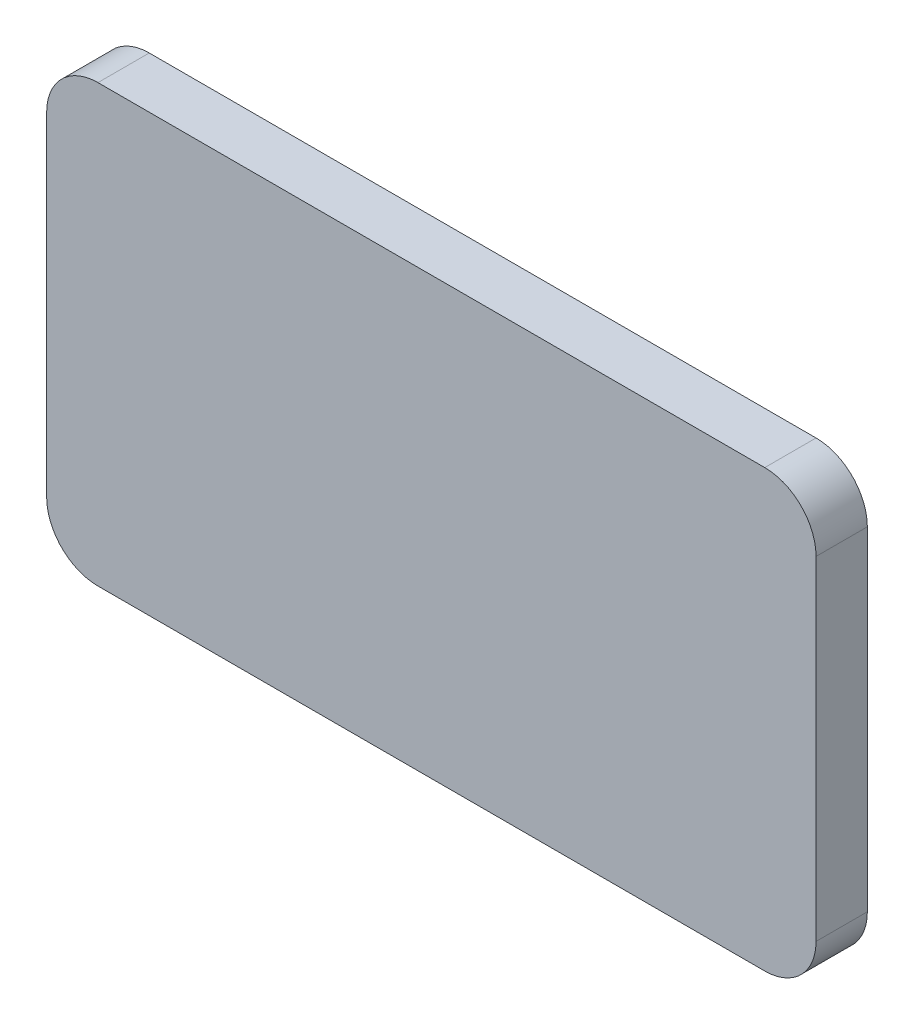
ISO-10303-21;
HEADER;
FILE_DESCRIPTION(('STEP AP214'),'2;1');
FILE_NAME('part.step','',(''),(''),'','','');
FILE_SCHEMA(('AUTOMOTIVE_DESIGN { 1 0 10303 214 1 1 1 1 }'));
ENDSEC;
DATA;
#1=APPLICATION_CONTEXT('core data for automotive mechanical design processes');
#2=APPLICATION_PROTOCOL_DEFINITION('international standard','automotive_design',2000,#1);
#3=PRODUCT_CONTEXT('',#1,'mechanical');
#4=PRODUCT('Part','Part','',(#3));
#5=PRODUCT_RELATED_PRODUCT_CATEGORY('part','',(#4));
#6=PRODUCT_DEFINITION_FORMATION('','',#4);
#7=PRODUCT_DEFINITION_CONTEXT('part definition',#1,'design');
#8=PRODUCT_DEFINITION('design','',#6,#7);
#9=PRODUCT_DEFINITION_SHAPE('','',#8);
#10=(LENGTH_UNIT() NAMED_UNIT(*) SI_UNIT(.MILLI.,.METRE.));
#11=(NAMED_UNIT(*) PLANE_ANGLE_UNIT() SI_UNIT($,.RADIAN.));
#12=(NAMED_UNIT(*) SI_UNIT($,.STERADIAN.) SOLID_ANGLE_UNIT());
#13=UNCERTAINTY_MEASURE_WITH_UNIT(LENGTH_MEASURE(1.E-05),#10,'distance_accuracy_value','');
#14=(GEOMETRIC_REPRESENTATION_CONTEXT(3) GLOBAL_UNCERTAINTY_ASSIGNED_CONTEXT((#13)) GLOBAL_UNIT_ASSIGNED_CONTEXT((#10,
#11,#12)) REPRESENTATION_CONTEXT('',''));
#15=CARTESIAN_POINT('',(0.,0.,0.));
#16=DIRECTION('',(0.,0.,1.));
#17=DIRECTION('',(1.,0.,0.));
#18=AXIS2_PLACEMENT_3D('',#15,#16,#17);
#19=CARTESIAN_POINT('',(0.,0.,2.));
#20=DIRECTION('',(1.,0.,0.));
#21=DIRECTION('',(0.,1.,0.));
#22=AXIS2_PLACEMENT_3D('',#19,#20,#21);
#23=PLANE('',#22);
#24=DIRECTION('',(0.,-1.,0.));
#25=VECTOR('',#24,1.);
#26=CARTESIAN_POINT('',(0.,0.,2.));
#27=LINE('',#26,#25);
#28=CARTESIAN_POINT('',(0.,-2.,2.));
#29=VERTEX_POINT('',#28);
#30=CARTESIAN_POINT('',(0.,-15.,2.));
#31=VERTEX_POINT('',#30);
#32=EDGE_CURVE('E117',#29,#31,#27,.T.);
#33=ORIENTED_EDGE('',*,*,#32,.F.);
#34=DIRECTION('',(0.,0.,-1.));
#35=VECTOR('',#34,1.);
#36=CARTESIAN_POINT('',(0.,-2.,2.));
#37=LINE('',#36,#35);
#38=CARTESIAN_POINT('',(0.,-2.,0.));
#39=VERTEX_POINT('',#38);
#40=EDGE_CURVE('E102',#29,#39,#37,.T.);
#41=ORIENTED_EDGE('',*,*,#40,.T.);
#42=DIRECTION('',(0.,-1.,0.));
#43=VECTOR('',#42,1.);
#44=CARTESIAN_POINT('',(0.,0.,0.));
#45=LINE('',#44,#43);
#46=CARTESIAN_POINT('',(0.,-15.,0.));
#47=VERTEX_POINT('',#46);
#48=EDGE_CURVE('E114',#39,#47,#45,.T.);
#49=ORIENTED_EDGE('',*,*,#48,.T.);
#50=DIRECTION('',(0.,0.,-1.));
#51=VECTOR('',#50,1.);
#52=CARTESIAN_POINT('',(0.,-15.,2.));
#53=LINE('',#52,#51);
#54=EDGE_CURVE('E119',#47,#31,#53,.F.);
#55=ORIENTED_EDGE('',*,*,#54,.T.);
#56=EDGE_LOOP('',(#33,#41,#49,#55));
#57=FACE_BOUND('',#56,.T.);
#58=ADVANCED_FACE('F32',(#57),#23,.F.);
#59=CARTESIAN_POINT('',(0.,-17.,2.));
#60=DIRECTION('',(0.,1.,0.));
#61=DIRECTION('',(0.,0.,1.));
#62=AXIS2_PLACEMENT_3D('',#59,#60,#61);
#63=PLANE('',#62);
#64=DIRECTION('',(1.,0.,0.));
#65=VECTOR('',#64,1.);
#66=CARTESIAN_POINT('',(0.,-17.,2.));
#67=LINE('',#66,#65);
#68=CARTESIAN_POINT('',(2.,-17.,2.));
#69=VERTEX_POINT('',#68);
#70=CARTESIAN_POINT('',(28.,-17.,2.));
#71=VERTEX_POINT('',#70);
#72=EDGE_CURVE('E159',#69,#71,#67,.T.);
#73=ORIENTED_EDGE('',*,*,#72,.F.);
#74=DIRECTION('',(0.,0.,-1.));
#75=VECTOR('',#74,1.);
#76=CARTESIAN_POINT('',(2.,-17.,2.));
#77=LINE('',#76,#75);
#78=CARTESIAN_POINT('',(2.,-17.,0.));
#79=VERTEX_POINT('',#78);
#80=EDGE_CURVE('E152',#69,#79,#77,.T.);
#81=ORIENTED_EDGE('',*,*,#80,.T.);
#82=DIRECTION('',(1.,0.,0.));
#83=VECTOR('',#82,1.);
#84=CARTESIAN_POINT('',(0.,-17.,0.));
#85=LINE('',#84,#83);
#86=CARTESIAN_POINT('',(28.,-17.,0.));
#87=VERTEX_POINT('',#86);
#88=EDGE_CURVE('E123',#79,#87,#85,.T.);
#89=ORIENTED_EDGE('',*,*,#88,.T.);
#90=DIRECTION('',(0.,0.,-1.));
#91=VECTOR('',#90,1.);
#92=CARTESIAN_POINT('',(28.,-17.,2.));
#93=LINE('',#92,#91);
#94=EDGE_CURVE('E150',#87,#71,#93,.F.);
#95=ORIENTED_EDGE('',*,*,#94,.T.);
#96=EDGE_LOOP('',(#73,#81,#89,#95));
#97=FACE_BOUND('',#96,.T.);
#98=ADVANCED_FACE('F157',(#97),#63,.F.);
#99=CARTESIAN_POINT('',(30.,0.,2.));
#100=DIRECTION('',(-1.,0.,0.));
#101=DIRECTION('',(0.,0.,1.));
#102=AXIS2_PLACEMENT_3D('',#99,#100,#101);
#103=PLANE('',#102);
#104=DIRECTION('',(0.,1.,0.));
#105=VECTOR('',#104,1.);
#106=CARTESIAN_POINT('',(30.,0.,2.));
#107=LINE('',#106,#105);
#108=CARTESIAN_POINT('',(30.,-15.,2.));
#109=VERTEX_POINT('',#108);
#110=CARTESIAN_POINT('',(30.,-2.,2.));
#111=VERTEX_POINT('',#110);
#112=EDGE_CURVE('E167',#109,#111,#107,.T.);
#113=ORIENTED_EDGE('',*,*,#112,.F.);
#114=DIRECTION('',(0.,0.,-1.));
#115=VECTOR('',#114,1.);
#116=CARTESIAN_POINT('',(30.,-15.,2.));
#117=LINE('',#116,#115);
#118=CARTESIAN_POINT('',(30.,-15.,0.));
#119=VERTEX_POINT('',#118);
#120=EDGE_CURVE('E11',#109,#119,#117,.T.);
#121=ORIENTED_EDGE('',*,*,#120,.T.);
#122=DIRECTION('',(0.,1.,0.));
#123=VECTOR('',#122,1.);
#124=CARTESIAN_POINT('',(30.,0.,0.));
#125=LINE('',#124,#123);
#126=CARTESIAN_POINT('',(30.,-2.,0.));
#127=VERTEX_POINT('',#126);
#128=EDGE_CURVE('E126',#119,#127,#125,.T.);
#129=ORIENTED_EDGE('',*,*,#128,.T.);
#130=DIRECTION('',(0.,0.,-1.));
#131=VECTOR('',#130,1.);
#132=CARTESIAN_POINT('',(30.,-2.,2.));
#133=LINE('',#132,#131);
#134=EDGE_CURVE('E40',#127,#111,#133,.F.);
#135=ORIENTED_EDGE('',*,*,#134,.T.);
#136=EDGE_LOOP('',(#113,#121,#129,#135));
#137=FACE_BOUND('',#136,.T.);
#138=ADVANCED_FACE('F166',(#137),#103,.F.);
#139=CARTESIAN_POINT('',(0.,0.,2.));
#140=DIRECTION('',(0.,-1.,0.));
#141=DIRECTION('',(0.,0.,-1.));
#142=AXIS2_PLACEMENT_3D('',#139,#140,#141);
#143=PLANE('',#142);
#144=DIRECTION('',(-1.,0.,0.));
#145=VECTOR('',#144,1.);
#146=CARTESIAN_POINT('',(0.,0.,0.));
#147=LINE('',#146,#145);
#148=CARTESIAN_POINT('',(28.,0.,0.));
#149=VERTEX_POINT('',#148);
#150=CARTESIAN_POINT('',(2.,0.,0.));
#151=VERTEX_POINT('',#150);
#152=EDGE_CURVE('E133',#149,#151,#147,.T.);
#153=ORIENTED_EDGE('',*,*,#152,.T.);
#154=DIRECTION('',(0.,0.,-1.));
#155=VECTOR('',#154,1.);
#156=CARTESIAN_POINT('',(2.,0.,2.));
#157=LINE('',#156,#155);
#158=CARTESIAN_POINT('',(2.,0.,2.));
#159=VERTEX_POINT('',#158);
#160=EDGE_CURVE('E103',#151,#159,#157,.F.);
#161=ORIENTED_EDGE('',*,*,#160,.T.);
#162=DIRECTION('',(-1.,0.,0.));
#163=VECTOR('',#162,1.);
#164=CARTESIAN_POINT('',(0.,0.,2.));
#165=LINE('',#164,#163);
#166=CARTESIAN_POINT('',(28.,0.,2.));
#167=VERTEX_POINT('',#166);
#168=EDGE_CURVE('E129',#167,#159,#165,.T.);
#169=ORIENTED_EDGE('',*,*,#168,.F.);
#170=DIRECTION('',(0.,0.,-1.));
#171=VECTOR('',#170,1.);
#172=CARTESIAN_POINT('',(28.,0.,2.));
#173=LINE('',#172,#171);
#174=EDGE_CURVE('E108',#167,#149,#173,.T.);
#175=ORIENTED_EDGE('',*,*,#174,.T.);
#176=EDGE_LOOP('',(#153,#161,#169,#175));
#177=FACE_BOUND('',#176,.T.);
#178=ADVANCED_FACE('F190',(#177),#143,.F.);
#179=CARTESIAN_POINT('',(0.,0.,2.));
#180=DIRECTION('',(0.,0.,1.));
#181=DIRECTION('',(1.,0.,0.));
#182=AXIS2_PLACEMENT_3D('',#179,#180,#181);
#183=PLANE('',#182);
#184=ORIENTED_EDGE('',*,*,#168,.T.);
#185=CARTESIAN_POINT('',(2.,-2.,2.));
#186=DIRECTION('',(0.,0.,1.));
#187=DIRECTION('',(1.,0.,0.));
#188=AXIS2_PLACEMENT_3D('',#185,#186,#187);
#189=CIRCLE('',#188,2.);
#190=EDGE_CURVE('E148',#159,#29,#189,.T.);
#191=ORIENTED_EDGE('',*,*,#190,.T.);
#192=ORIENTED_EDGE('',*,*,#32,.T.);
#193=CARTESIAN_POINT('',(2.,-15.,2.));
#194=DIRECTION('',(0.,0.,1.));
#195=DIRECTION('',(1.,0.,0.));
#196=AXIS2_PLACEMENT_3D('',#193,#194,#195);
#197=CIRCLE('',#196,2.);
#198=EDGE_CURVE('E146',#31,#69,#197,.T.);
#199=ORIENTED_EDGE('',*,*,#198,.T.);
#200=ORIENTED_EDGE('',*,*,#72,.T.);
#201=CARTESIAN_POINT('',(28.,-15.,2.));
#202=DIRECTION('',(0.,0.,1.));
#203=DIRECTION('',(1.,0.,0.));
#204=AXIS2_PLACEMENT_3D('',#201,#202,#203);
#205=CIRCLE('',#204,2.);
#206=EDGE_CURVE('E53',#71,#109,#205,.T.);
#207=ORIENTED_EDGE('',*,*,#206,.T.);
#208=ORIENTED_EDGE('',*,*,#112,.T.);
#209=CARTESIAN_POINT('',(28.,-2.,2.));
#210=DIRECTION('',(0.,0.,1.));
#211=DIRECTION('',(1.,0.,0.));
#212=AXIS2_PLACEMENT_3D('',#209,#210,#211);
#213=CIRCLE('',#212,2.);
#214=EDGE_CURVE('E143',#111,#167,#213,.T.);
#215=ORIENTED_EDGE('',*,*,#214,.T.);
#216=EDGE_LOOP('',(#184,#191,#192,#199,#200,#207,#208,#215));
#217=FACE_BOUND('',#216,.T.);
#218=ADVANCED_FACE('F172',(#217),#183,.T.);
#219=CARTESIAN_POINT('',(0.,0.,0.));
#220=DIRECTION('',(0.,0.,1.));
#221=DIRECTION('',(1.,0.,0.));
#222=AXIS2_PLACEMENT_3D('',#219,#220,#221);
#223=PLANE('',#222);
#224=ORIENTED_EDGE('',*,*,#48,.F.);
#225=CARTESIAN_POINT('',(2.,-2.,0.));
#226=DIRECTION('',(0.,0.,1.));
#227=DIRECTION('',(1.,0.,0.));
#228=AXIS2_PLACEMENT_3D('',#225,#226,#227);
#229=CIRCLE('',#228,2.);
#230=EDGE_CURVE('E98',#39,#151,#229,.F.);
#231=ORIENTED_EDGE('',*,*,#230,.T.);
#232=ORIENTED_EDGE('',*,*,#152,.F.);
#233=CARTESIAN_POINT('',(28.,-2.,0.));
#234=DIRECTION('',(0.,0.,1.));
#235=DIRECTION('',(1.,0.,0.));
#236=AXIS2_PLACEMENT_3D('',#233,#234,#235);
#237=CIRCLE('',#236,2.);
#238=EDGE_CURVE('E118',#149,#127,#237,.F.);
#239=ORIENTED_EDGE('',*,*,#238,.T.);
#240=ORIENTED_EDGE('',*,*,#128,.F.);
#241=CARTESIAN_POINT('',(28.,-15.,0.));
#242=DIRECTION('',(0.,0.,1.));
#243=DIRECTION('',(1.,0.,0.));
#244=AXIS2_PLACEMENT_3D('',#241,#242,#243);
#245=CIRCLE('',#244,2.);
#246=EDGE_CURVE('E137',#119,#87,#245,.F.);
#247=ORIENTED_EDGE('',*,*,#246,.T.);
#248=ORIENTED_EDGE('',*,*,#88,.F.);
#249=CARTESIAN_POINT('',(2.,-15.,0.));
#250=DIRECTION('',(0.,0.,1.));
#251=DIRECTION('',(1.,0.,0.));
#252=AXIS2_PLACEMENT_3D('',#249,#250,#251);
#253=CIRCLE('',#252,2.);
#254=EDGE_CURVE('E109',#79,#47,#253,.F.);
#255=ORIENTED_EDGE('',*,*,#254,.T.);
#256=EDGE_LOOP('',(#224,#231,#232,#239,#240,#247,#248,#255));
#257=FACE_BOUND('',#256,.T.);
#258=ADVANCED_FACE('F121',(#257),#223,.F.);
#259=CARTESIAN_POINT('',(2.,-2.,2.));
#260=DIRECTION('',(0.,0.,-1.));
#261=DIRECTION('',(-1.,0.,0.));
#262=AXIS2_PLACEMENT_3D('',#259,#260,#261);
#263=CYLINDRICAL_SURFACE('',#262,2.);
#264=ORIENTED_EDGE('',*,*,#190,.F.);
#265=ORIENTED_EDGE('',*,*,#160,.F.);
#266=ORIENTED_EDGE('',*,*,#230,.F.);
#267=ORIENTED_EDGE('',*,*,#40,.F.);
#268=EDGE_LOOP('',(#264,#265,#266,#267));
#269=FACE_BOUND('',#268,.T.);
#270=ADVANCED_FACE('F101',(#269),#263,.T.);
#271=CARTESIAN_POINT('',(2.,-15.,2.));
#272=DIRECTION('',(0.,0.,-1.));
#273=DIRECTION('',(-1.,0.,0.));
#274=AXIS2_PLACEMENT_3D('',#271,#272,#273);
#275=CYLINDRICAL_SURFACE('',#274,2.);
#276=ORIENTED_EDGE('',*,*,#198,.F.);
#277=ORIENTED_EDGE('',*,*,#54,.F.);
#278=ORIENTED_EDGE('',*,*,#254,.F.);
#279=ORIENTED_EDGE('',*,*,#80,.F.);
#280=EDGE_LOOP('',(#276,#277,#278,#279));
#281=FACE_BOUND('',#280,.T.);
#282=ADVANCED_FACE('F173',(#281),#275,.T.);
#283=CARTESIAN_POINT('',(28.,-15.,2.));
#284=DIRECTION('',(0.,0.,-1.));
#285=DIRECTION('',(-1.,0.,0.));
#286=AXIS2_PLACEMENT_3D('',#283,#284,#285);
#287=CYLINDRICAL_SURFACE('',#286,2.);
#288=ORIENTED_EDGE('',*,*,#206,.F.);
#289=ORIENTED_EDGE('',*,*,#94,.F.);
#290=ORIENTED_EDGE('',*,*,#246,.F.);
#291=ORIENTED_EDGE('',*,*,#120,.F.);
#292=EDGE_LOOP('',(#288,#289,#290,#291));
#293=FACE_BOUND('',#292,.T.);
#294=ADVANCED_FACE('F165',(#293),#287,.T.);
#295=CARTESIAN_POINT('',(28.,-2.,2.));
#296=DIRECTION('',(0.,0.,-1.));
#297=DIRECTION('',(-1.,0.,0.));
#298=AXIS2_PLACEMENT_3D('',#295,#296,#297);
#299=CYLINDRICAL_SURFACE('',#298,2.);
#300=ORIENTED_EDGE('',*,*,#214,.F.);
#301=ORIENTED_EDGE('',*,*,#134,.F.);
#302=ORIENTED_EDGE('',*,*,#238,.F.);
#303=ORIENTED_EDGE('',*,*,#174,.F.);
#304=EDGE_LOOP('',(#300,#301,#302,#303));
#305=FACE_BOUND('',#304,.T.);
#306=ADVANCED_FACE('F34',(#305),#299,.T.);
#307=CLOSED_SHELL('',(#58,#98,#138,#178,#218,#258,#270,#282,#294,#306));
#308=MANIFOLD_SOLID_BREP('B2',#307);
#309=ADVANCED_BREP_SHAPE_REPRESENTATION('',(#18,#308),#14);
#310=SHAPE_DEFINITION_REPRESENTATION(#9,#309);
ENDSEC;
END-ISO-10303-21;
